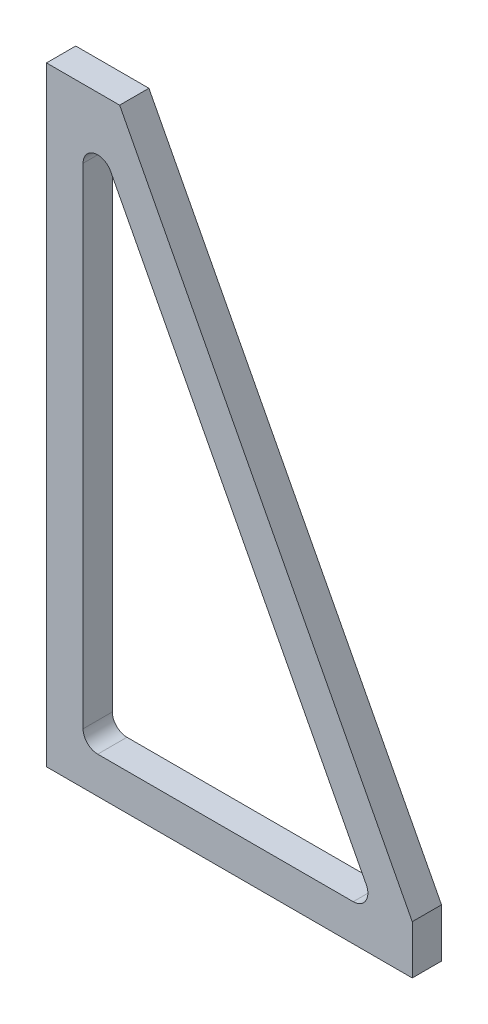
ISO-10303-21;
HEADER;
FILE_DESCRIPTION(('STEP AP214'),'2;1');
FILE_NAME('part.step','',(''),(''),'','','');
FILE_SCHEMA(('AUTOMOTIVE_DESIGN { 1 0 10303 214 1 1 1 1 }'));
ENDSEC;
DATA;
#1=APPLICATION_CONTEXT('core data for automotive mechanical design processes');
#2=APPLICATION_PROTOCOL_DEFINITION('international standard','automotive_design',2000,#1);
#3=PRODUCT_CONTEXT('',#1,'mechanical');
#4=PRODUCT('Part','Part','',(#3));
#5=PRODUCT_RELATED_PRODUCT_CATEGORY('part','',(#4));
#6=PRODUCT_DEFINITION_FORMATION('','',#4);
#7=PRODUCT_DEFINITION_CONTEXT('part definition',#1,'design');
#8=PRODUCT_DEFINITION('design','',#6,#7);
#9=PRODUCT_DEFINITION_SHAPE('','',#8);
#10=(LENGTH_UNIT() NAMED_UNIT(*) SI_UNIT(.MILLI.,.METRE.));
#11=(NAMED_UNIT(*) PLANE_ANGLE_UNIT() SI_UNIT($,.RADIAN.));
#12=(NAMED_UNIT(*) SI_UNIT($,.STERADIAN.) SOLID_ANGLE_UNIT());
#13=UNCERTAINTY_MEASURE_WITH_UNIT(LENGTH_MEASURE(1.E-05),#10,'distance_accuracy_value','');
#14=(GEOMETRIC_REPRESENTATION_CONTEXT(3) GLOBAL_UNCERTAINTY_ASSIGNED_CONTEXT((#13)) GLOBAL_UNIT_ASSIGNED_CONTEXT((#10,
#11,#12)) REPRESENTATION_CONTEXT('',''));
#15=CARTESIAN_POINT('',(0.,0.,0.));
#16=DIRECTION('',(0.,0.,1.));
#17=DIRECTION('',(1.,0.,0.));
#18=AXIS2_PLACEMENT_3D('',#15,#16,#17);
#19=CARTESIAN_POINT('',(0.,0.,12.));
#20=DIRECTION('',(0.,0.,1.));
#21=DIRECTION('',(1.,0.,0.));
#22=AXIS2_PLACEMENT_3D('',#19,#20,#21);
#23=PLANE('',#22);
#24=DIRECTION('',(0.,-1.,0.));
#25=VECTOR('',#24,1.);
#26=CARTESIAN_POINT('',(0.,250.,12.));
#27=LINE('',#26,#25);
#28=CARTESIAN_POINT('',(0.,250.,12.));
#29=VERTEX_POINT('',#28);
#30=CARTESIAN_POINT('',(0.,0.,12.));
#31=VERTEX_POINT('',#30);
#32=EDGE_CURVE('E175',#29,#31,#27,.T.);
#33=ORIENTED_EDGE('',*,*,#32,.T.);
#34=DIRECTION('',(1.,0.,0.));
#35=VECTOR('',#34,1.);
#36=CARTESIAN_POINT('',(0.,0.,12.));
#37=LINE('',#36,#35);
#38=CARTESIAN_POINT('',(150.,0.,12.));
#39=VERTEX_POINT('',#38);
#40=EDGE_CURVE('E178',#31,#39,#37,.T.);
#41=ORIENTED_EDGE('',*,*,#40,.T.);
#42=DIRECTION('',(0.,1.,0.));
#43=VECTOR('',#42,1.);
#44=CARTESIAN_POINT('',(150.,0.,12.));
#45=LINE('',#44,#43);
#46=CARTESIAN_POINT('',(150.,20.,12.));
#47=VERTEX_POINT('',#46);
#48=EDGE_CURVE('E181',#39,#47,#45,.T.);
#49=ORIENTED_EDGE('',*,*,#48,.T.);
#50=DIRECTION('',(-0.46256600669502,0.886584846165455,0.));
#51=VECTOR('',#50,1.);
#52=CARTESIAN_POINT('',(150.,20.,12.));
#53=LINE('',#52,#51);
#54=CARTESIAN_POINT('',(30.,250.,12.));
#55=VERTEX_POINT('',#54);
#56=EDGE_CURVE('E183',#47,#55,#53,.T.);
#57=ORIENTED_EDGE('',*,*,#56,.T.);
#58=DIRECTION('',(-1.,0.,0.));
#59=VECTOR('',#58,1.);
#60=CARTESIAN_POINT('',(30.,250.,12.));
#61=LINE('',#60,#59);
#62=EDGE_CURVE('E185',#55,#29,#61,.T.);
#63=ORIENTED_EDGE('',*,*,#62,.T.);
#64=EDGE_LOOP('',(#33,#41,#49,#57,#63));
#65=FACE_BOUND('',#64,.T.);
#66=DIRECTION('',(-0.46256600669502,0.886584846165455,0.));
#67=VECTOR('',#66,1.);
#68=CARTESIAN_POINT('',(131.111373668947,23.7753960401702,12.));
#69=LINE('',#68,#67);
#70=CARTESIAN_POINT('',(131.111373668947,23.7753960401702,12.));
#71=VERTEX_POINT('',#70);
#72=CARTESIAN_POINT('',(26.3195090769929,224.626469841415,12.));
#73=VERTEX_POINT('',#72);
#74=EDGE_CURVE('E132',#71,#73,#69,.T.);
#75=ORIENTED_EDGE('',*,*,#74,.F.);
#76=CARTESIAN_POINT('',(125.791864591954,21.,12.));
#77=DIRECTION('',(0.,0.,1.));
#78=DIRECTION('',(-1.,0.,0.));
#79=AXIS2_PLACEMENT_3D('',#76,#77,#78);
#80=CIRCLE('',#79,6.);
#81=CARTESIAN_POINT('',(125.791864591954,15.,12.));
#82=VERTEX_POINT('',#81);
#83=EDGE_CURVE('E124',#82,#71,#80,.T.);
#84=ORIENTED_EDGE('',*,*,#83,.F.);
#85=DIRECTION('',(1.,0.,0.));
#86=VECTOR('',#85,1.);
#87=CARTESIAN_POINT('',(21.,15.,12.));
#88=LINE('',#87,#86);
#89=CARTESIAN_POINT('',(21.,15.,12.));
#90=VERTEX_POINT('',#89);
#91=EDGE_CURVE('E153',#90,#82,#88,.T.);
#92=ORIENTED_EDGE('',*,*,#91,.F.);
#93=CARTESIAN_POINT('',(21.,21.,12.));
#94=DIRECTION('',(0.,0.,1.));
#95=DIRECTION('',(-1.,0.,0.));
#96=AXIS2_PLACEMENT_3D('',#93,#94,#95);
#97=CIRCLE('',#96,6.);
#98=CARTESIAN_POINT('',(15.,21.,12.));
#99=VERTEX_POINT('',#98);
#100=EDGE_CURVE('E151',#99,#90,#97,.T.);
#101=ORIENTED_EDGE('',*,*,#100,.F.);
#102=DIRECTION('',(0.,-1.,0.));
#103=VECTOR('',#102,1.);
#104=CARTESIAN_POINT('',(15.,221.851073801245,12.));
#105=LINE('',#104,#103);
#106=CARTESIAN_POINT('',(15.,221.851073801245,12.));
#107=VERTEX_POINT('',#106);
#108=EDGE_CURVE('E147',#107,#99,#105,.T.);
#109=ORIENTED_EDGE('',*,*,#108,.F.);
#110=CARTESIAN_POINT('',(21.,221.851073801245,12.));
#111=DIRECTION('',(0.,0.,1.));
#112=DIRECTION('',(-1.,0.,0.));
#113=AXIS2_PLACEMENT_3D('',#110,#111,#112);
#114=CIRCLE('',#113,6.);
#115=EDGE_CURVE('E145',#73,#107,#114,.T.);
#116=ORIENTED_EDGE('',*,*,#115,.F.);
#117=EDGE_LOOP('',(#75,#84,#92,#101,#109,#116));
#118=FACE_BOUND('',#117,.T.);
#119=ADVANCED_FACE('F41',(#65,#118),#23,.T.);
#120=CARTESIAN_POINT('',(0.,0.,0.));
#121=DIRECTION('',(0.,0.,1.));
#122=DIRECTION('',(1.,0.,0.));
#123=AXIS2_PLACEMENT_3D('',#120,#121,#122);
#124=PLANE('',#123);
#125=DIRECTION('',(0.,-1.,0.));
#126=VECTOR('',#125,1.);
#127=CARTESIAN_POINT('',(0.,250.,0.));
#128=LINE('',#127,#126);
#129=CARTESIAN_POINT('',(0.,250.,0.));
#130=VERTEX_POINT('',#129);
#131=CARTESIAN_POINT('',(0.,0.,0.));
#132=VERTEX_POINT('',#131);
#133=EDGE_CURVE('E140',#130,#132,#128,.T.);
#134=ORIENTED_EDGE('',*,*,#133,.F.);
#135=DIRECTION('',(-1.,0.,0.));
#136=VECTOR('',#135,1.);
#137=CARTESIAN_POINT('',(30.,250.,0.));
#138=LINE('',#137,#136);
#139=CARTESIAN_POINT('',(30.,250.,0.));
#140=VERTEX_POINT('',#139);
#141=EDGE_CURVE('E179',#140,#130,#138,.T.);
#142=ORIENTED_EDGE('',*,*,#141,.F.);
#143=DIRECTION('',(-0.46256600669502,0.886584846165455,0.));
#144=VECTOR('',#143,1.);
#145=CARTESIAN_POINT('',(150.,20.,0.));
#146=LINE('',#145,#144);
#147=CARTESIAN_POINT('',(150.,20.,0.));
#148=VERTEX_POINT('',#147);
#149=EDGE_CURVE('E194',#148,#140,#146,.T.);
#150=ORIENTED_EDGE('',*,*,#149,.F.);
#151=DIRECTION('',(0.,1.,0.));
#152=VECTOR('',#151,1.);
#153=CARTESIAN_POINT('',(150.,0.,0.));
#154=LINE('',#153,#152);
#155=CARTESIAN_POINT('',(150.,0.,0.));
#156=VERTEX_POINT('',#155);
#157=EDGE_CURVE('E192',#156,#148,#154,.T.);
#158=ORIENTED_EDGE('',*,*,#157,.F.);
#159=DIRECTION('',(1.,0.,0.));
#160=VECTOR('',#159,1.);
#161=CARTESIAN_POINT('',(0.,0.,0.));
#162=LINE('',#161,#160);
#163=EDGE_CURVE('E190',#132,#156,#162,.T.);
#164=ORIENTED_EDGE('',*,*,#163,.F.);
#165=EDGE_LOOP('',(#134,#142,#150,#158,#164));
#166=FACE_BOUND('',#165,.T.);
#167=CARTESIAN_POINT('',(125.791864591954,21.,0.));
#168=DIRECTION('',(0.,0.,1.));
#169=DIRECTION('',(-1.,0.,0.));
#170=AXIS2_PLACEMENT_3D('',#167,#168,#169);
#171=CIRCLE('',#170,6.);
#172=CARTESIAN_POINT('',(125.791864591954,15.,0.));
#173=VERTEX_POINT('',#172);
#174=CARTESIAN_POINT('',(131.111373668947,23.7753960401702,0.));
#175=VERTEX_POINT('',#174);
#176=EDGE_CURVE('E64',#173,#175,#171,.T.);
#177=ORIENTED_EDGE('',*,*,#176,.T.);
#178=DIRECTION('',(-0.46256600669502,0.886584846165455,0.));
#179=VECTOR('',#178,1.);
#180=CARTESIAN_POINT('',(131.111373668947,23.7753960401702,0.));
#181=LINE('',#180,#179);
#182=CARTESIAN_POINT('',(26.3195090769929,224.626469841415,0.));
#183=VERTEX_POINT('',#182);
#184=EDGE_CURVE('E139',#175,#183,#181,.T.);
#185=ORIENTED_EDGE('',*,*,#184,.T.);
#186=CARTESIAN_POINT('',(21.,221.851073801245,0.));
#187=DIRECTION('',(0.,0.,1.));
#188=DIRECTION('',(-1.,0.,0.));
#189=AXIS2_PLACEMENT_3D('',#186,#187,#188);
#190=CIRCLE('',#189,6.);
#191=CARTESIAN_POINT('',(15.,221.851073801245,0.));
#192=VERTEX_POINT('',#191);
#193=EDGE_CURVE('E157',#183,#192,#190,.T.);
#194=ORIENTED_EDGE('',*,*,#193,.T.);
#195=DIRECTION('',(0.,-1.,0.));
#196=VECTOR('',#195,1.);
#197=CARTESIAN_POINT('',(15.,221.851073801245,0.));
#198=LINE('',#197,#196);
#199=CARTESIAN_POINT('',(15.,21.,0.));
#200=VERTEX_POINT('',#199);
#201=EDGE_CURVE('E160',#192,#200,#198,.T.);
#202=ORIENTED_EDGE('',*,*,#201,.T.);
#203=CARTESIAN_POINT('',(21.,21.,0.));
#204=DIRECTION('',(0.,0.,1.));
#205=DIRECTION('',(-1.,0.,0.));
#206=AXIS2_PLACEMENT_3D('',#203,#204,#205);
#207=CIRCLE('',#206,6.);
#208=CARTESIAN_POINT('',(21.,15.,0.));
#209=VERTEX_POINT('',#208);
#210=EDGE_CURVE('E163',#200,#209,#207,.T.);
#211=ORIENTED_EDGE('',*,*,#210,.T.);
#212=DIRECTION('',(1.,0.,0.));
#213=VECTOR('',#212,1.);
#214=CARTESIAN_POINT('',(21.,15.,0.));
#215=LINE('',#214,#213);
#216=EDGE_CURVE('E133',#209,#173,#215,.T.);
#217=ORIENTED_EDGE('',*,*,#216,.T.);
#218=EDGE_LOOP('',(#177,#185,#194,#202,#211,#217));
#219=FACE_BOUND('',#218,.T.);
#220=ADVANCED_FACE('F215',(#166,#219),#124,.F.);
#221=CARTESIAN_POINT('',(0.,250.,12.));
#222=DIRECTION('',(1.,0.,0.));
#223=DIRECTION('',(0.,1.,0.));
#224=AXIS2_PLACEMENT_3D('',#221,#222,#223);
#225=PLANE('',#224);
#226=ORIENTED_EDGE('',*,*,#133,.T.);
#227=DIRECTION('',(0.,0.,-1.));
#228=VECTOR('',#227,1.);
#229=CARTESIAN_POINT('',(0.,0.,12.));
#230=LINE('',#229,#228);
#231=EDGE_CURVE('E11',#31,#132,#230,.T.);
#232=ORIENTED_EDGE('',*,*,#231,.F.);
#233=ORIENTED_EDGE('',*,*,#32,.F.);
#234=DIRECTION('',(0.,0.,-1.));
#235=VECTOR('',#234,1.);
#236=CARTESIAN_POINT('',(0.,250.,12.));
#237=LINE('',#236,#235);
#238=EDGE_CURVE('E187',#29,#130,#237,.T.);
#239=ORIENTED_EDGE('',*,*,#238,.T.);
#240=EDGE_LOOP('',(#226,#232,#233,#239));
#241=FACE_BOUND('',#240,.T.);
#242=ADVANCED_FACE('F43',(#241),#225,.F.);
#243=CARTESIAN_POINT('',(0.,0.,12.));
#244=DIRECTION('',(0.,1.,0.));
#245=DIRECTION('',(0.,0.,1.));
#246=AXIS2_PLACEMENT_3D('',#243,#244,#245);
#247=PLANE('',#246);
#248=ORIENTED_EDGE('',*,*,#163,.T.);
#249=DIRECTION('',(0.,0.,-1.));
#250=VECTOR('',#249,1.);
#251=CARTESIAN_POINT('',(150.,0.,12.));
#252=LINE('',#251,#250);
#253=EDGE_CURVE('E49',#39,#156,#252,.T.);
#254=ORIENTED_EDGE('',*,*,#253,.F.);
#255=ORIENTED_EDGE('',*,*,#40,.F.);
#256=ORIENTED_EDGE('',*,*,#231,.T.);
#257=EDGE_LOOP('',(#248,#254,#255,#256));
#258=FACE_BOUND('',#257,.T.);
#259=ADVANCED_FACE('F229',(#258),#247,.F.);
#260=CARTESIAN_POINT('',(150.,0.,12.));
#261=DIRECTION('',(-1.,0.,0.));
#262=DIRECTION('',(0.,0.,1.));
#263=AXIS2_PLACEMENT_3D('',#260,#261,#262);
#264=PLANE('',#263);
#265=ORIENTED_EDGE('',*,*,#157,.T.);
#266=DIRECTION('',(0.,0.,-1.));
#267=VECTOR('',#266,1.);
#268=CARTESIAN_POINT('',(150.,20.,12.));
#269=LINE('',#268,#267);
#270=EDGE_CURVE('E202',#47,#148,#269,.T.);
#271=ORIENTED_EDGE('',*,*,#270,.F.);
#272=ORIENTED_EDGE('',*,*,#48,.F.);
#273=ORIENTED_EDGE('',*,*,#253,.T.);
#274=EDGE_LOOP('',(#265,#271,#272,#273));
#275=FACE_BOUND('',#274,.T.);
#276=ADVANCED_FACE('F209',(#275),#264,.F.);
#277=CARTESIAN_POINT('',(150.,20.,12.));
#278=DIRECTION('',(-0.886584846165455,-0.46256600669502,0.));
#279=DIRECTION('',(0.46256600669502,-0.886584846165455,0.));
#280=AXIS2_PLACEMENT_3D('',#277,#278,#279);
#281=PLANE('',#280);
#282=ORIENTED_EDGE('',*,*,#149,.T.);
#283=DIRECTION('',(0.,0.,-1.));
#284=VECTOR('',#283,1.);
#285=CARTESIAN_POINT('',(30.,250.,12.));
#286=LINE('',#285,#284);
#287=EDGE_CURVE('E199',#55,#140,#286,.T.);
#288=ORIENTED_EDGE('',*,*,#287,.F.);
#289=ORIENTED_EDGE('',*,*,#56,.F.);
#290=ORIENTED_EDGE('',*,*,#270,.T.);
#291=EDGE_LOOP('',(#282,#288,#289,#290));
#292=FACE_BOUND('',#291,.T.);
#293=ADVANCED_FACE('F220',(#292),#281,.F.);
#294=CARTESIAN_POINT('',(30.,250.,12.));
#295=DIRECTION('',(0.,-1.,0.));
#296=DIRECTION('',(0.,0.,-1.));
#297=AXIS2_PLACEMENT_3D('',#294,#295,#296);
#298=PLANE('',#297);
#299=ORIENTED_EDGE('',*,*,#141,.T.);
#300=ORIENTED_EDGE('',*,*,#238,.F.);
#301=ORIENTED_EDGE('',*,*,#62,.F.);
#302=ORIENTED_EDGE('',*,*,#287,.T.);
#303=EDGE_LOOP('',(#299,#300,#301,#302));
#304=FACE_BOUND('',#303,.T.);
#305=ADVANCED_FACE('F224',(#304),#298,.F.);
#306=CARTESIAN_POINT('',(125.791864591954,21.,12.));
#307=DIRECTION('',(0.,0.,-1.));
#308=DIRECTION('',(-1.,0.,0.));
#309=AXIS2_PLACEMENT_3D('',#306,#307,#308);
#310=CYLINDRICAL_SURFACE('',#309,6.);
#311=ORIENTED_EDGE('',*,*,#176,.F.);
#312=DIRECTION('',(0.,0.,-1.));
#313=VECTOR('',#312,1.);
#314=CARTESIAN_POINT('',(125.791864591954,15.,12.));
#315=LINE('',#314,#313);
#316=EDGE_CURVE('E128',#82,#173,#315,.T.);
#317=ORIENTED_EDGE('',*,*,#316,.F.);
#318=ORIENTED_EDGE('',*,*,#83,.T.);
#319=DIRECTION('',(0.,0.,-1.));
#320=VECTOR('',#319,1.);
#321=CARTESIAN_POINT('',(131.111373668947,23.7753960401702,12.));
#322=LINE('',#321,#320);
#323=EDGE_CURVE('E127',#71,#175,#322,.T.);
#324=ORIENTED_EDGE('',*,*,#323,.T.);
#325=EDGE_LOOP('',(#311,#317,#318,#324));
#326=FACE_BOUND('',#325,.T.);
#327=ADVANCED_FACE('F126',(#326),#310,.F.);
#328=CARTESIAN_POINT('',(131.111373668947,23.7753960401702,12.));
#329=DIRECTION('',(-0.886584846165455,-0.46256600669502,0.));
#330=DIRECTION('',(0.46256600669502,-0.886584846165455,0.));
#331=AXIS2_PLACEMENT_3D('',#328,#329,#330);
#332=PLANE('',#331);
#333=ORIENTED_EDGE('',*,*,#184,.F.);
#334=ORIENTED_EDGE('',*,*,#323,.F.);
#335=ORIENTED_EDGE('',*,*,#74,.T.);
#336=DIRECTION('',(0.,0.,-1.));
#337=VECTOR('',#336,1.);
#338=CARTESIAN_POINT('',(26.3195090769929,224.626469841415,12.));
#339=LINE('',#338,#337);
#340=EDGE_CURVE('E141',#73,#183,#339,.T.);
#341=ORIENTED_EDGE('',*,*,#340,.T.);
#342=EDGE_LOOP('',(#333,#334,#335,#341));
#343=FACE_BOUND('',#342,.T.);
#344=ADVANCED_FACE('F136',(#343),#332,.T.);
#345=CARTESIAN_POINT('',(21.,221.851073801245,12.));
#346=DIRECTION('',(0.,0.,-1.));
#347=DIRECTION('',(-1.,0.,0.));
#348=AXIS2_PLACEMENT_3D('',#345,#346,#347);
#349=CYLINDRICAL_SURFACE('',#348,6.);
#350=ORIENTED_EDGE('',*,*,#193,.F.);
#351=ORIENTED_EDGE('',*,*,#340,.F.);
#352=ORIENTED_EDGE('',*,*,#115,.T.);
#353=DIRECTION('',(0.,0.,-1.));
#354=VECTOR('',#353,1.);
#355=CARTESIAN_POINT('',(15.,221.851073801245,12.));
#356=LINE('',#355,#354);
#357=EDGE_CURVE('E172',#107,#192,#356,.T.);
#358=ORIENTED_EDGE('',*,*,#357,.T.);
#359=EDGE_LOOP('',(#350,#351,#352,#358));
#360=FACE_BOUND('',#359,.T.);
#361=ADVANCED_FACE('F272',(#360),#349,.F.);
#362=CARTESIAN_POINT('',(15.,221.851073801245,12.));
#363=DIRECTION('',(1.,0.,0.));
#364=DIRECTION('',(0.,1.,0.));
#365=AXIS2_PLACEMENT_3D('',#362,#363,#364);
#366=PLANE('',#365);
#367=ORIENTED_EDGE('',*,*,#201,.F.);
#368=ORIENTED_EDGE('',*,*,#357,.F.);
#369=ORIENTED_EDGE('',*,*,#108,.T.);
#370=DIRECTION('',(0.,0.,-1.));
#371=VECTOR('',#370,1.);
#372=CARTESIAN_POINT('',(15.,21.,12.));
#373=LINE('',#372,#371);
#374=EDGE_CURVE('E170',#99,#200,#373,.T.);
#375=ORIENTED_EDGE('',*,*,#374,.T.);
#376=EDGE_LOOP('',(#367,#368,#369,#375));
#377=FACE_BOUND('',#376,.T.);
#378=ADVANCED_FACE('F278',(#377),#366,.T.);
#379=CARTESIAN_POINT('',(21.,21.,12.));
#380=DIRECTION('',(0.,0.,-1.));
#381=DIRECTION('',(-1.,0.,0.));
#382=AXIS2_PLACEMENT_3D('',#379,#380,#381);
#383=CYLINDRICAL_SURFACE('',#382,6.);
#384=ORIENTED_EDGE('',*,*,#210,.F.);
#385=ORIENTED_EDGE('',*,*,#374,.F.);
#386=ORIENTED_EDGE('',*,*,#100,.T.);
#387=DIRECTION('',(0.,0.,-1.));
#388=VECTOR('',#387,1.);
#389=CARTESIAN_POINT('',(21.,15.,12.));
#390=LINE('',#389,#388);
#391=EDGE_CURVE('E56',#90,#209,#390,.T.);
#392=ORIENTED_EDGE('',*,*,#391,.T.);
#393=EDGE_LOOP('',(#384,#385,#386,#392));
#394=FACE_BOUND('',#393,.T.);
#395=ADVANCED_FACE('F286',(#394),#383,.F.);
#396=CARTESIAN_POINT('',(21.,15.,12.));
#397=DIRECTION('',(0.,1.,0.));
#398=DIRECTION('',(-1.,0.,0.));
#399=AXIS2_PLACEMENT_3D('',#396,#397,#398);
#400=PLANE('',#399);
#401=ORIENTED_EDGE('',*,*,#216,.F.);
#402=ORIENTED_EDGE('',*,*,#391,.F.);
#403=ORIENTED_EDGE('',*,*,#91,.T.);
#404=ORIENTED_EDGE('',*,*,#316,.T.);
#405=EDGE_LOOP('',(#401,#402,#403,#404));
#406=FACE_BOUND('',#405,.T.);
#407=ADVANCED_FACE('F294',(#406),#400,.T.);
#408=CLOSED_SHELL('',(#119,#220,#242,#259,#276,#293,#305,#327,#344,#361,#378,#395,#407));
#409=MANIFOLD_SOLID_BREP('B2',#408);
#410=ADVANCED_BREP_SHAPE_REPRESENTATION('',(#18,#409),#14);
#411=SHAPE_DEFINITION_REPRESENTATION(#9,#410);
ENDSEC;
END-ISO-10303-21;
